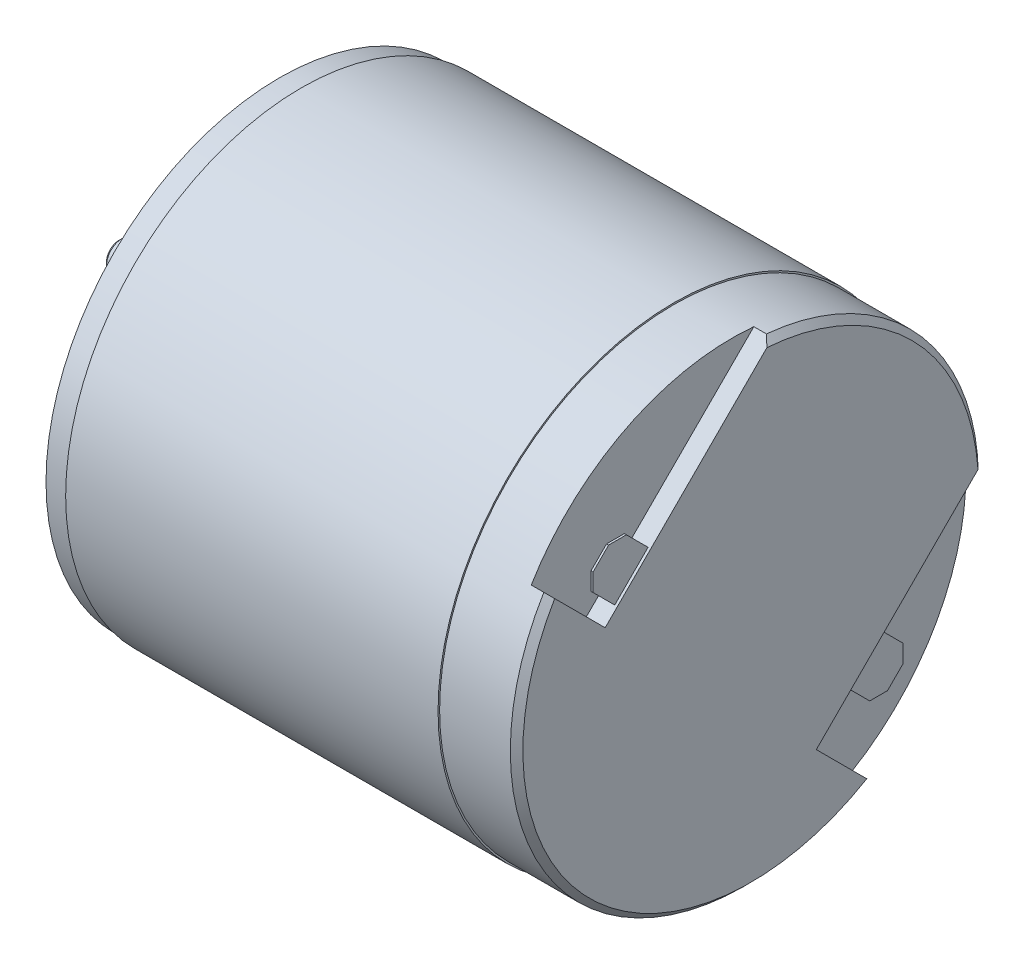
ISO-10303-21;
HEADER;
FILE_DESCRIPTION(('STEP AP214'),'2;1');
FILE_NAME('part.step','',(''),(''),'','','');
FILE_SCHEMA(('AUTOMOTIVE_DESIGN { 1 0 10303 214 1 1 1 1 }'));
ENDSEC;
DATA;
#1=APPLICATION_CONTEXT('core data for automotive mechanical design processes');
#2=APPLICATION_PROTOCOL_DEFINITION('international standard','automotive_design',2000,#1);
#3=PRODUCT_CONTEXT('',#1,'mechanical');
#4=PRODUCT('Part','Part','',(#3));
#5=PRODUCT_RELATED_PRODUCT_CATEGORY('part','',(#4));
#6=PRODUCT_DEFINITION_FORMATION('','',#4);
#7=PRODUCT_DEFINITION_CONTEXT('part definition',#1,'design');
#8=PRODUCT_DEFINITION('design','',#6,#7);
#9=PRODUCT_DEFINITION_SHAPE('','',#8);
#10=(LENGTH_UNIT() NAMED_UNIT(*) SI_UNIT(.MILLI.,.METRE.));
#11=(NAMED_UNIT(*) PLANE_ANGLE_UNIT() SI_UNIT($,.RADIAN.));
#12=(NAMED_UNIT(*) SI_UNIT($,.STERADIAN.) SOLID_ANGLE_UNIT());
#13=UNCERTAINTY_MEASURE_WITH_UNIT(LENGTH_MEASURE(1.E-05),#10,'distance_accuracy_value','');
#14=(GEOMETRIC_REPRESENTATION_CONTEXT(3) GLOBAL_UNCERTAINTY_ASSIGNED_CONTEXT((#13)) GLOBAL_UNIT_ASSIGNED_CONTEXT((#10,
#11,#12)) REPRESENTATION_CONTEXT('',''));
#15=CARTESIAN_POINT('',(0.,0.,0.));
#16=DIRECTION('',(0.,0.,1.));
#17=DIRECTION('',(1.,0.,0.));
#18=AXIS2_PLACEMENT_3D('',#15,#16,#17);
#19=CARTESIAN_POINT('',(0.,0.,0.));
#20=DIRECTION('',(-1.,0.,0.));
#21=DIRECTION('',(0.,0.,1.));
#22=AXIS2_PLACEMENT_3D('',#19,#20,#21);
#23=PLANE('',#22);
#24=DIRECTION('',(0.,0.707106781186548,0.707106781186548));
#25=VECTOR('',#24,1.);
#26=CARTESIAN_POINT('',(0.,-19.0062950903902,-13.9151262658471));
#27=LINE('',#26,#25);
#28=CARTESIAN_POINT('',(0.,4.17193000900063,9.26309883354377));
#29=VERTEX_POINT('',#28);
#30=CARTESIAN_POINT('',(0.,7.38643451642566,12.4776033409688));
#31=VERTEX_POINT('',#30);
#32=EDGE_CURVE('E252',#29,#31,#27,.T.);
#33=ORIENTED_EDGE('',*,*,#32,.T.);
#34=CARTESIAN_POINT('',(0.,0.,0.));
#35=DIRECTION('',(-1.,0.,0.));
#36=DIRECTION('',(0.,0.,1.));
#37=AXIS2_PLACEMENT_3D('',#34,#35,#36);
#38=CIRCLE('',#37,14.5);
#39=CARTESIAN_POINT('',(0.,-12.4776033409688,-7.38643451642566));
#40=VERTEX_POINT('',#39);
#41=EDGE_CURVE('E383',#31,#40,#38,.F.);
#42=ORIENTED_EDGE('',*,*,#41,.T.);
#43=DIRECTION('',(0.,-0.707106781186548,-0.707106781186548));
#44=VECTOR('',#43,1.);
#45=CARTESIAN_POINT('',(0.,-19.0062950903902,-13.9151262658471));
#46=LINE('',#45,#44);
#47=CARTESIAN_POINT('',(0.,-9.26309883354377,-4.17193000900063));
#48=VERTEX_POINT('',#47);
#49=EDGE_CURVE('E238',#48,#40,#46,.T.);
#50=ORIENTED_EDGE('',*,*,#49,.F.);
#51=DIRECTION('',(0.,-0.707106781186547,0.707106781186548));
#52=VECTOR('',#51,1.);
#53=CARTESIAN_POINT('',(0.,9.74319625684644,-23.1782250993909));
#54=LINE('',#53,#52);
#55=CARTESIAN_POINT('',(0.,1.0284522711426,-14.463481113687));
#56=VERTEX_POINT('',#55);
#57=EDGE_CURVE('E236',#56,#48,#54,.T.);
#58=ORIENTED_EDGE('',*,*,#57,.F.);
#59=CARTESIAN_POINT('',(0.,0.,0.));
#60=DIRECTION('',(-1.,0.,0.));
#61=DIRECTION('',(0.,0.,1.));
#62=AXIS2_PLACEMENT_3D('',#59,#60,#61);
#63=CIRCLE('',#62,14.5);
#64=CARTESIAN_POINT('',(0.,14.463481113687,-1.02845227114266));
#65=VERTEX_POINT('',#64);
#66=EDGE_CURVE('E46',#56,#65,#63,.F.);
#67=ORIENTED_EDGE('',*,*,#66,.T.);
#68=DIRECTION('',(0.,-0.707106781186546,0.707106781186549));
#69=VECTOR('',#68,1.);
#70=CARTESIAN_POINT('',(0.,23.1782250993909,-9.74319625684651));
#71=LINE('',#70,#69);
#72=EDGE_CURVE('E260',#65,#29,#71,.T.);
#73=ORIENTED_EDGE('',*,*,#72,.T.);
#74=EDGE_LOOP('',(#33,#42,#50,#58,#67,#73));
#75=FACE_BOUND('',#74,.T.);
#76=ADVANCED_FACE('F32',(#75),#23,.F.);
#77=CARTESIAN_POINT('',(0.,0.,0.));
#78=DIRECTION('',(-1.,0.,0.));
#79=DIRECTION('',(0.,0.,1.));
#80=AXIS2_PLACEMENT_3D('',#77,#78,#79);
#81=CYLINDRICAL_SURFACE('',#80,14.9);
#82=DIRECTION('',(1.,0.,0.));
#83=VECTOR('',#82,1.);
#84=CARTESIAN_POINT('',(-1.2,-12.7693312792475,-7.67816245470436));
#85=LINE('',#84,#83);
#86=CARTESIAN_POINT('',(-1.2,-12.7693312792475,-7.67816245470436));
#87=VERTEX_POINT('',#86);
#88=CARTESIAN_POINT('',(-0.4,-12.7693312792475,-7.67816245470436));
#89=VERTEX_POINT('',#88);
#90=EDGE_CURVE('E253',#87,#89,#85,.T.);
#91=ORIENTED_EDGE('',*,*,#90,.T.);
#92=CARTESIAN_POINT('',(-0.399999999999999,0.,0.));
#93=DIRECTION('',(-1.,0.,0.));
#94=DIRECTION('',(0.,0.,1.));
#95=AXIS2_PLACEMENT_3D('',#92,#93,#94);
#96=CIRCLE('',#95,14.9);
#97=CARTESIAN_POINT('',(-0.4,7.67816245470436,12.7693312792475));
#98=VERTEX_POINT('',#97);
#99=EDGE_CURVE('E349',#89,#98,#96,.T.);
#100=ORIENTED_EDGE('',*,*,#99,.T.);
#101=DIRECTION('',(1.,0.,0.));
#102=VECTOR('',#101,1.);
#103=CARTESIAN_POINT('',(-1.2,7.67816245470436,12.7693312792475));
#104=LINE('',#103,#102);
#105=CARTESIAN_POINT('',(-1.2,7.67816245470436,12.7693312792475));
#106=VERTEX_POINT('',#105);
#107=EDGE_CURVE('E271',#106,#98,#104,.T.);
#108=ORIENTED_EDGE('',*,*,#107,.F.);
#109=CARTESIAN_POINT('',(-1.2,0.,0.));
#110=DIRECTION('',(1.,0.,0.));
#111=DIRECTION('',(0.,0.,-1.));
#112=AXIS2_PLACEMENT_3D('',#109,#110,#111);
#113=CIRCLE('',#112,14.9);
#114=CARTESIAN_POINT('',(-1.2,14.8341639763534,-1.39913513380904));
#115=VERTEX_POINT('',#114);
#116=EDGE_CURVE('E267',#106,#115,#113,.F.);
#117=ORIENTED_EDGE('',*,*,#116,.T.);
#118=DIRECTION('',(1.,0.,0.));
#119=VECTOR('',#118,1.);
#120=CARTESIAN_POINT('',(-1.2,14.8341639763534,-1.39913513380904));
#121=LINE('',#120,#119);
#122=CARTESIAN_POINT('',(-0.399999999999998,14.8341639763534,-1.39913513380904));
#123=VERTEX_POINT('',#122);
#124=EDGE_CURVE('E275',#115,#123,#121,.T.);
#125=ORIENTED_EDGE('',*,*,#124,.T.);
#126=CARTESIAN_POINT('',(-0.399999999999999,0.,0.));
#127=DIRECTION('',(-1.,0.,0.));
#128=DIRECTION('',(0.,0.,1.));
#129=AXIS2_PLACEMENT_3D('',#126,#127,#128);
#130=CIRCLE('',#129,14.9);
#131=CARTESIAN_POINT('',(-0.400000000000001,1.39913513380898,-14.8341639763534));
#132=VERTEX_POINT('',#131);
#133=EDGE_CURVE('E346',#123,#132,#130,.T.);
#134=ORIENTED_EDGE('',*,*,#133,.T.);
#135=DIRECTION('',(1.,0.,0.));
#136=VECTOR('',#135,1.);
#137=CARTESIAN_POINT('',(-1.2,1.39913513380898,-14.8341639763534));
#138=LINE('',#137,#136);
#139=CARTESIAN_POINT('',(-1.2,1.39913513380898,-14.8341639763534));
#140=VERTEX_POINT('',#139);
#141=EDGE_CURVE('E250',#140,#132,#138,.T.);
#142=ORIENTED_EDGE('',*,*,#141,.F.);
#143=CARTESIAN_POINT('',(-1.2,0.,0.));
#144=DIRECTION('',(1.,0.,0.));
#145=DIRECTION('',(0.,0.,-1.));
#146=AXIS2_PLACEMENT_3D('',#143,#144,#145);
#147=CIRCLE('',#146,14.9);
#148=EDGE_CURVE('E246',#140,#87,#147,.F.);
#149=ORIENTED_EDGE('',*,*,#148,.T.);
#150=EDGE_LOOP('',(#91,#100,#108,#117,#125,#134,#142,#149));
#151=FACE_BOUND('',#150,.T.);
#152=CARTESIAN_POINT('',(-4.9,0.,0.));
#153=DIRECTION('',(-1.,0.,0.));
#154=DIRECTION('',(0.,0.,1.));
#155=AXIS2_PLACEMENT_3D('',#152,#153,#154);
#156=CIRCLE('',#155,14.9);
#157=CARTESIAN_POINT('',(-4.9,0.,14.9));
#158=VERTEX_POINT('',#157);
#159=EDGE_CURVE('E303',#158,#158,#156,.T.);
#160=ORIENTED_EDGE('',*,*,#159,.F.);
#161=EDGE_LOOP('',(#160));
#162=FACE_BOUND('',#161,.T.);
#163=ADVANCED_FACE('F425',(#151,#162),#81,.T.);
#164=CARTESIAN_POINT('',(-4.9,14.9,0.));
#165=DIRECTION('',(-1.,0.,0.));
#166=DIRECTION('',(0.,0.,1.));
#167=AXIS2_PLACEMENT_3D('',#164,#165,#166);
#168=PLANE('',#167);
#169=CARTESIAN_POINT('',(-4.9,0.,0.));
#170=DIRECTION('',(-1.,0.,0.));
#171=DIRECTION('',(0.,0.,1.));
#172=AXIS2_PLACEMENT_3D('',#169,#170,#171);
#173=CIRCLE('',#172,15.);
#174=CARTESIAN_POINT('',(-4.9,0.,15.));
#175=VERTEX_POINT('',#174);
#176=EDGE_CURVE('E300',#175,#175,#173,.T.);
#177=ORIENTED_EDGE('',*,*,#176,.F.);
#178=EDGE_LOOP('',(#177));
#179=FACE_BOUND('',#178,.T.);
#180=ORIENTED_EDGE('',*,*,#159,.T.);
#181=EDGE_LOOP('',(#180));
#182=FACE_BOUND('',#181,.T.);
#183=ADVANCED_FACE('F429',(#179,#182),#168,.F.);
#184=CARTESIAN_POINT('',(0.,0.,0.));
#185=DIRECTION('',(-1.,0.,0.));
#186=DIRECTION('',(0.,0.,1.));
#187=AXIS2_PLACEMENT_3D('',#184,#185,#186);
#188=CYLINDRICAL_SURFACE('',#187,15.);
#189=CARTESIAN_POINT('',(-28.6,0.,0.));
#190=DIRECTION('',(-1.,0.,0.));
#191=DIRECTION('',(0.,0.,1.));
#192=AXIS2_PLACEMENT_3D('',#189,#190,#191);
#193=CIRCLE('',#192,15.);
#194=CARTESIAN_POINT('',(-28.6,0.,15.));
#195=VERTEX_POINT('',#194);
#196=EDGE_CURVE('E297',#195,#195,#193,.T.);
#197=ORIENTED_EDGE('',*,*,#196,.F.);
#198=EDGE_LOOP('',(#197));
#199=FACE_BOUND('',#198,.T.);
#200=ORIENTED_EDGE('',*,*,#176,.T.);
#201=EDGE_LOOP('',(#200));
#202=FACE_BOUND('',#201,.T.);
#203=ADVANCED_FACE('F488',(#199,#202),#188,.T.);
#204=CARTESIAN_POINT('',(-28.6,15.,0.));
#205=DIRECTION('',(1.,0.,0.));
#206=DIRECTION('',(0.,0.,-1.));
#207=AXIS2_PLACEMENT_3D('',#204,#205,#206);
#208=PLANE('',#207);
#209=CARTESIAN_POINT('',(-28.6,0.,0.));
#210=DIRECTION('',(-1.,0.,0.));
#211=DIRECTION('',(0.,0.,1.));
#212=AXIS2_PLACEMENT_3D('',#209,#210,#211);
#213=CIRCLE('',#212,14.85);
#214=CARTESIAN_POINT('',(-28.6,0.,14.85));
#215=VERTEX_POINT('',#214);
#216=EDGE_CURVE('E294',#215,#215,#213,.T.);
#217=ORIENTED_EDGE('',*,*,#216,.F.);
#218=EDGE_LOOP('',(#217));
#219=FACE_BOUND('',#218,.T.);
#220=ORIENTED_EDGE('',*,*,#196,.T.);
#221=EDGE_LOOP('',(#220));
#222=FACE_BOUND('',#221,.T.);
#223=ADVANCED_FACE('F484',(#219,#222),#208,.F.);
#224=CARTESIAN_POINT('',(0.,0.,0.));
#225=DIRECTION('',(-1.,0.,0.));
#226=DIRECTION('',(0.,0.,1.));
#227=AXIS2_PLACEMENT_3D('',#224,#225,#226);
#228=CYLINDRICAL_SURFACE('',#227,14.85);
#229=CARTESIAN_POINT('',(-30.,0.,0.));
#230=DIRECTION('',(-1.,0.,0.));
#231=DIRECTION('',(0.,0.,1.));
#232=AXIS2_PLACEMENT_3D('',#229,#230,#231);
#233=CIRCLE('',#232,14.85);
#234=CARTESIAN_POINT('',(-30.,0.,14.85));
#235=VERTEX_POINT('',#234);
#236=EDGE_CURVE('E291',#235,#235,#233,.T.);
#237=ORIENTED_EDGE('',*,*,#236,.F.);
#238=EDGE_LOOP('',(#237));
#239=FACE_BOUND('',#238,.T.);
#240=ORIENTED_EDGE('',*,*,#216,.T.);
#241=EDGE_LOOP('',(#240));
#242=FACE_BOUND('',#241,.T.);
#243=ADVANCED_FACE('F480',(#239,#242),#228,.T.);
#244=CARTESIAN_POINT('',(-30.,14.85,0.));
#245=DIRECTION('',(1.,0.,0.));
#246=DIRECTION('',(0.,0.,-1.));
#247=AXIS2_PLACEMENT_3D('',#244,#245,#246);
#248=PLANE('',#247);
#249=CARTESIAN_POINT('',(-30.,0.,0.));
#250=DIRECTION('',(-1.,0.,0.));
#251=DIRECTION('',(0.,0.,1.));
#252=AXIS2_PLACEMENT_3D('',#249,#250,#251);
#253=CIRCLE('',#252,4.);
#254=CARTESIAN_POINT('',(-30.,0.,4.));
#255=VERTEX_POINT('',#254);
#256=EDGE_CURVE('E288',#255,#255,#253,.T.);
#257=ORIENTED_EDGE('',*,*,#256,.F.);
#258=EDGE_LOOP('',(#257));
#259=FACE_BOUND('',#258,.T.);
#260=ORIENTED_EDGE('',*,*,#236,.T.);
#261=EDGE_LOOP('',(#260));
#262=FACE_BOUND('',#261,.T.);
#263=ADVANCED_FACE('F476',(#259,#262),#248,.F.);
#264=CARTESIAN_POINT('',(0.,0.,0.));
#265=DIRECTION('',(-1.,0.,0.));
#266=DIRECTION('',(0.,0.,1.));
#267=AXIS2_PLACEMENT_3D('',#264,#265,#266);
#268=CYLINDRICAL_SURFACE('',#267,4.);
#269=CARTESIAN_POINT('',(-30.9,0.,0.));
#270=DIRECTION('',(-1.,0.,0.));
#271=DIRECTION('',(0.,0.,1.));
#272=AXIS2_PLACEMENT_3D('',#269,#270,#271);
#273=CIRCLE('',#272,4.);
#274=CARTESIAN_POINT('',(-30.9,0.,4.));
#275=VERTEX_POINT('',#274);
#276=EDGE_CURVE('E285',#275,#275,#273,.T.);
#277=ORIENTED_EDGE('',*,*,#276,.F.);
#278=EDGE_LOOP('',(#277));
#279=FACE_BOUND('',#278,.T.);
#280=ORIENTED_EDGE('',*,*,#256,.T.);
#281=EDGE_LOOP('',(#280));
#282=FACE_BOUND('',#281,.T.);
#283=ADVANCED_FACE('F472',(#279,#282),#268,.T.);
#284=CARTESIAN_POINT('',(-30.9,4.,0.));
#285=DIRECTION('',(1.,0.,0.));
#286=DIRECTION('',(0.,0.,-1.));
#287=AXIS2_PLACEMENT_3D('',#284,#285,#286);
#288=PLANE('',#287);
#289=CARTESIAN_POINT('',(-30.9,0.,0.));
#290=DIRECTION('',(-1.,0.,0.));
#291=DIRECTION('',(0.,0.,1.));
#292=AXIS2_PLACEMENT_3D('',#289,#290,#291);
#293=CIRCLE('',#292,2.1);
#294=CARTESIAN_POINT('',(-30.9,0.,2.1));
#295=VERTEX_POINT('',#294);
#296=EDGE_CURVE('E282',#295,#295,#293,.T.);
#297=ORIENTED_EDGE('',*,*,#296,.F.);
#298=EDGE_LOOP('',(#297));
#299=FACE_BOUND('',#298,.T.);
#300=ORIENTED_EDGE('',*,*,#276,.T.);
#301=EDGE_LOOP('',(#300));
#302=FACE_BOUND('',#301,.T.);
#303=ADVANCED_FACE('F468',(#299,#302),#288,.F.);
#304=CARTESIAN_POINT('',(0.,0.,0.));
#305=DIRECTION('',(-1.,0.,0.));
#306=DIRECTION('',(0.,0.,1.));
#307=AXIS2_PLACEMENT_3D('',#304,#305,#306);
#308=CYLINDRICAL_SURFACE('',#307,2.1);
#309=CARTESIAN_POINT('',(-31.8,0.,0.));
#310=DIRECTION('',(1.,0.,0.));
#311=DIRECTION('',(0.,0.,-1.));
#312=AXIS2_PLACEMENT_3D('',#309,#310,#311);
#313=CIRCLE('',#312,2.1);
#314=CARTESIAN_POINT('',(-31.8,0.,-2.1));
#315=VERTEX_POINT('',#314);
#316=EDGE_CURVE('E11',#315,#315,#313,.T.);
#317=ORIENTED_EDGE('',*,*,#316,.T.);
#318=EDGE_LOOP('',(#317));
#319=FACE_BOUND('',#318,.T.);
#320=ORIENTED_EDGE('',*,*,#296,.T.);
#321=EDGE_LOOP('',(#320));
#322=FACE_BOUND('',#321,.T.);
#323=ADVANCED_FACE('F465',(#319,#322),#308,.T.);
#324=CARTESIAN_POINT('',(-32.,2.1,0.));
#325=DIRECTION('',(1.,0.,0.));
#326=DIRECTION('',(0.,0.,-1.));
#327=AXIS2_PLACEMENT_3D('',#324,#325,#326);
#328=PLANE('',#327);
#329=CARTESIAN_POINT('',(-32.,0.,0.));
#330=DIRECTION('',(1.,0.,0.));
#331=DIRECTION('',(0.,0.,-1.));
#332=AXIS2_PLACEMENT_3D('',#329,#330,#331);
#333=CIRCLE('',#332,1.98452994616208);
#334=CARTESIAN_POINT('',(-32.,0.,-1.98452994616208));
#335=VERTEX_POINT('',#334);
#336=EDGE_CURVE('E39',#335,#335,#333,.F.);
#337=ORIENTED_EDGE('',*,*,#336,.T.);
#338=EDGE_LOOP('',(#337));
#339=FACE_BOUND('',#338,.T.);
#340=CARTESIAN_POINT('',(-32.,0.,0.));
#341=DIRECTION('',(-1.,0.,0.));
#342=DIRECTION('',(0.,0.,1.));
#343=AXIS2_PLACEMENT_3D('',#340,#341,#342);
#344=CIRCLE('',#343,1.);
#345=CARTESIAN_POINT('',(-32.,0.,1.));
#346=VERTEX_POINT('',#345);
#347=EDGE_CURVE('E274',#346,#346,#344,.T.);
#348=ORIENTED_EDGE('',*,*,#347,.F.);
#349=EDGE_LOOP('',(#348));
#350=FACE_BOUND('',#349,.T.);
#351=ADVANCED_FACE('F413',(#339,#350),#328,.F.);
#352=CARTESIAN_POINT('',(0.,0.,0.));
#353=DIRECTION('',(-1.,0.,0.));
#354=DIRECTION('',(0.,0.,1.));
#355=AXIS2_PLACEMENT_3D('',#352,#353,#354);
#356=CYLINDRICAL_SURFACE('',#355,1.);
#357=CARTESIAN_POINT('',(-40.,0.,0.));
#358=DIRECTION('',(1.,0.,0.));
#359=DIRECTION('',(0.,0.,-1.));
#360=AXIS2_PLACEMENT_3D('',#357,#358,#359);
#361=CIRCLE('',#360,1.);
#362=CARTESIAN_POINT('',(-40.,0.,-1.));
#363=VERTEX_POINT('',#362);
#364=EDGE_CURVE('E309',#363,#363,#361,.T.);
#365=ORIENTED_EDGE('',*,*,#364,.T.);
#366=EDGE_LOOP('',(#365));
#367=FACE_BOUND('',#366,.T.);
#368=ORIENTED_EDGE('',*,*,#347,.T.);
#369=EDGE_LOOP('',(#368));
#370=FACE_BOUND('',#369,.T.);
#371=ADVANCED_FACE('F455',(#367,#370),#356,.T.);
#372=CARTESIAN_POINT('',(-40.2,0.999999999999999,0.));
#373=DIRECTION('',(1.,0.,0.));
#374=DIRECTION('',(0.,0.,-1.));
#375=AXIS2_PLACEMENT_3D('',#372,#373,#374);
#376=PLANE('',#375);
#377=CARTESIAN_POINT('',(-40.2,0.,0.));
#378=DIRECTION('',(1.,0.,0.));
#379=DIRECTION('',(0.,0.,-1.));
#380=AXIS2_PLACEMENT_3D('',#377,#378,#379);
#381=CIRCLE('',#380,0.800000000000002);
#382=CARTESIAN_POINT('',(-40.2,0.,-0.800000000000002));
#383=VERTEX_POINT('',#382);
#384=EDGE_CURVE('E306',#383,#383,#381,.F.);
#385=ORIENTED_EDGE('',*,*,#384,.T.);
#386=EDGE_LOOP('',(#385));
#387=FACE_BOUND('',#386,.T.);
#388=ADVANCED_FACE('F451',(#387),#376,.F.);
#389=CARTESIAN_POINT('',(-1.2,-19.0062950903902,-13.9151262658471));
#390=DIRECTION('',(0.,0.707106781186548,-0.707106781186548));
#391=DIRECTION('',(0.,0.707106781186548,0.707106781186548));
#392=AXIS2_PLACEMENT_3D('',#389,#390,#391);
#393=PLANE('',#392);
#394=ORIENTED_EDGE('',*,*,#107,.T.);
#395=CARTESIAN_POINT('',(-0.399999999999999,7.67816245470436,12.7693312792475));
#396=CARTESIAN_POINT('',(-0.333303497507687,7.62956158627321,12.7207304108163));
#397=CARTESIAN_POINT('',(-0.266621912949534,7.58095049054999,12.6721193150931));
#398=CARTESIAN_POINT('',(-0.133288579616163,7.48370784445712,12.5748766690003));
#399=CARTESIAN_POINT('',(-0.0666368308409822,7.43507629408744,12.5262451186306));
#400=CARTESIAN_POINT('',(0.,7.38643451642566,12.4776033409688));
#401=B_SPLINE_CURVE_WITH_KNOTS('',3,(#395,#396,#397,#398,#399,#400),.UNSPECIFIED.,.F.,.F.,(4,2,
4),(0.,0.287319680436435,0.574639361240867),.UNSPECIFIED.);
#402=EDGE_CURVE('E352',#98,#31,#401,.T.);
#403=ORIENTED_EDGE('',*,*,#402,.T.);
#404=ORIENTED_EDGE('',*,*,#32,.F.);
#405=DIRECTION('',(1.,0.,0.));
#406=VECTOR('',#405,1.);
#407=CARTESIAN_POINT('',(-1.2,4.17193000900063,9.26309883354377));
#408=LINE('',#407,#406);
#409=CARTESIAN_POINT('',(-1.2,4.17193000900063,9.26309883354377));
#410=VERTEX_POINT('',#409);
#411=EDGE_CURVE('E270',#410,#29,#408,.T.);
#412=ORIENTED_EDGE('',*,*,#411,.F.);
#413=DIRECTION('',(0.,0.707106781186548,0.707106781186548));
#414=VECTOR('',#413,1.);
#415=CARTESIAN_POINT('',(-1.2,-19.0062950903902,-13.9151262658471));
#416=LINE('',#415,#414);
#417=EDGE_CURVE('E262',#410,#106,#416,.T.);
#418=ORIENTED_EDGE('',*,*,#417,.T.);
#419=EDGE_LOOP('',(#394,#403,#404,#412,#418));
#420=FACE_BOUND('',#419,.T.);
#421=ADVANCED_FACE('F360',(#420),#393,.T.);
#422=CARTESIAN_POINT('',(-1.2,23.1782250993909,-9.74319625684651));
#423=DIRECTION('',(0.,0.707106781186549,0.707106781186546));
#424=DIRECTION('',(0.,-0.707106781186546,0.707106781186549));
#425=AXIS2_PLACEMENT_3D('',#422,#423,#424);
#426=PLANE('',#425);
#427=DIRECTION('',(0.,0.707106781186548,-0.707106781186548));
#428=VECTOR('',#427,1.);
#429=CARTESIAN_POINT('',(-0.17,4.94974746830581,8.48528137423855));
#430=LINE('',#429,#428);
#431=CARTESIAN_POINT('',(-0.17,4.94974746830581,8.48528137423855));
#432=VERTEX_POINT('',#431);
#433=CARTESIAN_POINT('',(-0.17,7.07106781186546,6.36396103067891));
#434=VERTEX_POINT('',#433);
#435=EDGE_CURVE('E220',#432,#434,#430,.T.);
#436=ORIENTED_EDGE('',*,*,#435,.F.);
#437=DIRECTION('',(-1.,0.,0.));
#438=VECTOR('',#437,1.);
#439=CARTESIAN_POINT('',(-0.17,4.94974746830581,8.48528137423855));
#440=LINE('',#439,#438);
#441=CARTESIAN_POINT('',(-0.3,4.94974746830581,8.48528137423855));
#442=VERTEX_POINT('',#441);
#443=EDGE_CURVE('E231',#432,#442,#440,.T.);
#444=ORIENTED_EDGE('',*,*,#443,.T.);
#445=DIRECTION('',(0.,0.707106781186548,-0.707106781186548));
#446=VECTOR('',#445,1.);
#447=CARTESIAN_POINT('',(-0.3,4.94974746830581,8.48528137423855));
#448=LINE('',#447,#446);
#449=CARTESIAN_POINT('',(-0.3,7.07106781186548,6.36396103067892));
#450=VERTEX_POINT('',#449);
#451=EDGE_CURVE('E186',#442,#450,#448,.T.);
#452=ORIENTED_EDGE('',*,*,#451,.T.);
#453=DIRECTION('',(-1.,0.,0.));
#454=VECTOR('',#453,1.);
#455=CARTESIAN_POINT('',(-0.17,7.07106781186546,6.36396103067891));
#456=LINE('',#455,#454);
#457=EDGE_CURVE('E234',#434,#450,#456,.T.);
#458=ORIENTED_EDGE('',*,*,#457,.F.);
#459=EDGE_LOOP('',(#436,#444,#452,#458));
#460=FACE_BOUND('',#459,.T.);
#461=ORIENTED_EDGE('',*,*,#72,.F.);
#462=CARTESIAN_POINT('',(0.,14.463481113687,-1.02845227114266));
#463=CARTESIAN_POINT('',(-0.0662553103929144,14.5254835432952,-1.0904547007508));
#464=CARTESIAN_POINT('',(-0.132716301451681,14.5873749989757,-1.15234615643128));
#465=CARTESIAN_POINT('',(-0.266049634847051,14.7109359531643,-1.27590711061993));
#466=CARTESIAN_POINT('',(-0.332921977121617,14.7726054517059,-1.33757660916158));
#467=CARTESIAN_POINT('',(-0.399999999999999,14.8341639763534,-1.39913513380904));
#468=B_SPLINE_CURVE_WITH_KNOTS('',3,(#462,#463,#464,#465,#466,#467),.UNSPECIFIED.,.F.,.F.,(4,2,
4),(0.,0.32970215520239,0.659404260683057),.UNSPECIFIED.);
#469=EDGE_CURVE('E406',#65,#123,#468,.T.);
#470=ORIENTED_EDGE('',*,*,#469,.T.);
#471=ORIENTED_EDGE('',*,*,#124,.F.);
#472=DIRECTION('',(0.,-0.707106781186546,0.707106781186549));
#473=VECTOR('',#472,1.);
#474=CARTESIAN_POINT('',(-1.2,23.1782250993909,-9.74319625684651));
#475=LINE('',#474,#473);
#476=EDGE_CURVE('E265',#115,#410,#475,.T.);
#477=ORIENTED_EDGE('',*,*,#476,.T.);
#478=ORIENTED_EDGE('',*,*,#411,.T.);
#479=EDGE_LOOP('',(#461,#470,#471,#477,#478));
#480=FACE_BOUND('',#479,.T.);
#481=ADVANCED_FACE('F401',(#460,#480),#426,.T.);
#482=CARTESIAN_POINT('',(-1.2,0.,-32.9214213562373));
#483=DIRECTION('',(1.,0.,0.));
#484=DIRECTION('',(0.,0.,-1.));
#485=AXIS2_PLACEMENT_3D('',#482,#483,#484);
#486=PLANE('',#485);
#487=ORIENTED_EDGE('',*,*,#417,.F.);
#488=ORIENTED_EDGE('',*,*,#476,.F.);
#489=ORIENTED_EDGE('',*,*,#116,.F.);
#490=EDGE_LOOP('',(#487,#488,#489));
#491=FACE_BOUND('',#490,.T.);
#492=ADVANCED_FACE('F399',(#491),#486,.T.);
#493=CARTESIAN_POINT('',(-1.2,9.74319625684644,-23.1782250993909));
#494=DIRECTION('',(0.,0.707106781186548,0.707106781186547));
#495=DIRECTION('',(0.,-0.707106781186547,0.707106781186548));
#496=AXIS2_PLACEMENT_3D('',#493,#494,#495);
#497=PLANE('',#496);
#498=DIRECTION('',(-1.,0.,0.));
#499=VECTOR('',#498,1.);
#500=CARTESIAN_POINT('',(-0.17,-7.07106781186549,-6.36396103067895));
#501=LINE('',#500,#499);
#502=CARTESIAN_POINT('',(-0.17,-7.07106781186548,-6.36396103067893));
#503=VERTEX_POINT('',#502);
#504=CARTESIAN_POINT('',(-0.3,-7.07106781186546,-6.36396103067895));
#505=VERTEX_POINT('',#504);
#506=EDGE_CURVE('E187',#503,#505,#501,.T.);
#507=ORIENTED_EDGE('',*,*,#506,.F.);
#508=DIRECTION('',(0.,-0.707106781186548,0.707106781186547));
#509=VECTOR('',#508,1.);
#510=CARTESIAN_POINT('',(-0.17,-4.94974746830585,-8.48528137423859));
#511=LINE('',#510,#509);
#512=CARTESIAN_POINT('',(-0.17,-4.94974746830583,-8.48528137423858));
#513=VERTEX_POINT('',#512);
#514=EDGE_CURVE('E185',#513,#503,#511,.T.);
#515=ORIENTED_EDGE('',*,*,#514,.F.);
#516=DIRECTION('',(-1.,0.,0.));
#517=VECTOR('',#516,1.);
#518=CARTESIAN_POINT('',(-0.17,-4.94974746830585,-8.48528137423859));
#519=LINE('',#518,#517);
#520=CARTESIAN_POINT('',(-0.3,-4.94974746830585,-8.48528137423859));
#521=VERTEX_POINT('',#520);
#522=EDGE_CURVE('E173',#513,#521,#519,.T.);
#523=ORIENTED_EDGE('',*,*,#522,.T.);
#524=DIRECTION('',(0.,-0.707106781186548,0.707106781186547));
#525=VECTOR('',#524,1.);
#526=CARTESIAN_POINT('',(-0.3,-4.94974746830585,-8.48528137423859));
#527=LINE('',#526,#525);
#528=EDGE_CURVE('E178',#521,#505,#527,.T.);
#529=ORIENTED_EDGE('',*,*,#528,.T.);
#530=EDGE_LOOP('',(#507,#515,#523,#529));
#531=FACE_BOUND('',#530,.T.);
#532=ORIENTED_EDGE('',*,*,#141,.T.);
#533=CARTESIAN_POINT('',(-0.399999999999999,1.39913513380898,-14.8341639763534));
#534=CARTESIAN_POINT('',(-0.332921977121616,1.33757660916152,-14.772605451706));
#535=CARTESIAN_POINT('',(-0.266049634847049,1.27590711061988,-14.7109359531643));
#536=CARTESIAN_POINT('',(-0.132716301451679,1.15234615643123,-14.5873749989757));
#537=CARTESIAN_POINT('',(-0.0662553103929133,1.09045470075074,-14.5254835432952));
#538=CARTESIAN_POINT('',(0.,1.02845227114261,-14.463481113687));
#539=B_SPLINE_CURVE_WITH_KNOTS('',3,(#533,#534,#535,#536,#537,#538),.UNSPECIFIED.,.F.,.F.,(4,2,
4),(0.,0.329702105480666,0.659404260683055),.UNSPECIFIED.);
#540=EDGE_CURVE('E54',#132,#56,#539,.T.);
#541=ORIENTED_EDGE('',*,*,#540,.T.);
#542=ORIENTED_EDGE('',*,*,#57,.T.);
#543=DIRECTION('',(1.,0.,0.));
#544=VECTOR('',#543,1.);
#545=CARTESIAN_POINT('',(-1.2,-9.26309883354377,-4.17193000900063));
#546=LINE('',#545,#544);
#547=CARTESIAN_POINT('',(-1.2,-9.26309883354377,-4.17193000900063));
#548=VERTEX_POINT('',#547);
#549=EDGE_CURVE('E249',#548,#48,#546,.T.);
#550=ORIENTED_EDGE('',*,*,#549,.F.);
#551=DIRECTION('',(0.,-0.707106781186547,0.707106781186548));
#552=VECTOR('',#551,1.);
#553=CARTESIAN_POINT('',(-1.2,9.74319625684644,-23.1782250993909));
#554=LINE('',#553,#552);
#555=EDGE_CURVE('E241',#140,#548,#554,.T.);
#556=ORIENTED_EDGE('',*,*,#555,.F.);
#557=EDGE_LOOP('',(#532,#541,#542,#550,#556));
#558=FACE_BOUND('',#557,.T.);
#559=ADVANCED_FACE('F182',(#531,#558),#497,.F.);
#560=CARTESIAN_POINT('',(-1.2,-19.0062950903902,-13.9151262658471));
#561=DIRECTION('',(0.,-0.707106781186548,0.707106781186548));
#562=DIRECTION('',(0.,-0.707106781186548,-0.707106781186548));
#563=AXIS2_PLACEMENT_3D('',#560,#561,#562);
#564=PLANE('',#563);
#565=ORIENTED_EDGE('',*,*,#49,.T.);
#566=CARTESIAN_POINT('',(0.,-12.4776033409688,-7.38643451642566));
#567=CARTESIAN_POINT('',(-0.0666368308409826,-12.5262451186306,-7.43507629408744));
#568=CARTESIAN_POINT('',(-0.133288579616163,-12.5748766690003,-7.48370784445712));
#569=CARTESIAN_POINT('',(-0.266621912949535,-12.6721193150931,-7.58095049054999));
#570=CARTESIAN_POINT('',(-0.333303497507687,-12.7207304108163,-7.62956158627321));
#571=CARTESIAN_POINT('',(-0.399999999999999,-12.7693312792475,-7.67816245470436));
#572=B_SPLINE_CURVE_WITH_KNOTS('',3,(#566,#567,#568,#569,#570,#571),.UNSPECIFIED.,.F.,.F.,(4,2,
4),(0.,0.287319680804432,0.574639361240866),.UNSPECIFIED.);
#573=EDGE_CURVE('E377',#40,#89,#572,.T.);
#574=ORIENTED_EDGE('',*,*,#573,.T.);
#575=ORIENTED_EDGE('',*,*,#90,.F.);
#576=DIRECTION('',(0.,-0.707106781186548,-0.707106781186548));
#577=VECTOR('',#576,1.);
#578=CARTESIAN_POINT('',(-1.2,-19.0062950903902,-13.9151262658471));
#579=LINE('',#578,#577);
#580=EDGE_CURVE('E244',#548,#87,#579,.T.);
#581=ORIENTED_EDGE('',*,*,#580,.F.);
#582=ORIENTED_EDGE('',*,*,#549,.T.);
#583=EDGE_LOOP('',(#565,#574,#575,#581,#582));
#584=FACE_BOUND('',#583,.T.);
#585=ADVANCED_FACE('F389',(#584),#564,.F.);
#586=CARTESIAN_POINT('',(-1.2,0.,-32.9214213562373));
#587=DIRECTION('',(1.,0.,0.));
#588=DIRECTION('',(0.,0.,-1.));
#589=AXIS2_PLACEMENT_3D('',#586,#587,#588);
#590=PLANE('',#589);
#591=ORIENTED_EDGE('',*,*,#555,.T.);
#592=ORIENTED_EDGE('',*,*,#580,.T.);
#593=ORIENTED_EDGE('',*,*,#148,.F.);
#594=EDGE_LOOP('',(#591,#592,#593));
#595=FACE_BOUND('',#594,.T.);
#596=ADVANCED_FACE('F393',(#595),#590,.T.);
#597=CARTESIAN_POINT('',(-40.2,0.,0.));
#598=DIRECTION('',(1.,0.,0.));
#599=DIRECTION('',(0.,0.,-1.));
#600=AXIS2_PLACEMENT_3D('',#597,#598,#599);
#601=CONICAL_SURFACE('',#600,0.800000000000002,0.785398163397462);
#602=ORIENTED_EDGE('',*,*,#364,.F.);
#603=EDGE_LOOP('',(#602));
#604=FACE_BOUND('',#603,.T.);
#605=ORIENTED_EDGE('',*,*,#384,.F.);
#606=EDGE_LOOP('',(#605));
#607=FACE_BOUND('',#606,.T.);
#608=ADVANCED_FACE('F555',(#604,#607),#601,.T.);
#609=CARTESIAN_POINT('',(-0.17,7.07106781186546,6.36396103067891));
#610=DIRECTION('',(0.,-0.707106781186547,0.707106781186547));
#611=DIRECTION('',(0.,-0.707106781186548,-0.707106781186548));
#612=AXIS2_PLACEMENT_3D('',#609,#610,#611);
#613=PLANE('',#612);
#614=DIRECTION('',(0.,0.707106781186548,0.707106781186548));
#615=VECTOR('',#614,1.);
#616=CARTESIAN_POINT('',(-0.3,7.07106781186546,6.36396103067891));
#617=LINE('',#616,#615);
#618=CARTESIAN_POINT('',(-0.3,8.44992603517922,7.74281925399267));
#619=VERTEX_POINT('',#618);
#620=EDGE_CURVE('E212',#450,#619,#617,.T.);
#621=ORIENTED_EDGE('',*,*,#620,.T.);
#622=DIRECTION('',(1.,0.,0.));
#623=VECTOR('',#622,1.);
#624=CARTESIAN_POINT('',(-0.17,8.44992603517922,7.74281925399267));
#625=LINE('',#624,#623);
#626=CARTESIAN_POINT('',(-0.17,8.44992603517922,7.74281925399267));
#627=VERTEX_POINT('',#626);
#628=EDGE_CURVE('E344',#619,#627,#625,.T.);
#629=ORIENTED_EDGE('',*,*,#628,.T.);
#630=DIRECTION('',(0.,0.707106781186548,0.707106781186548));
#631=VECTOR('',#630,1.);
#632=CARTESIAN_POINT('',(-0.17,7.07106781186546,6.36396103067891));
#633=LINE('',#632,#631);
#634=EDGE_CURVE('E223',#434,#627,#633,.T.);
#635=ORIENTED_EDGE('',*,*,#634,.F.);
#636=ORIENTED_EDGE('',*,*,#457,.T.);
#637=EDGE_LOOP('',(#621,#629,#635,#636));
#638=FACE_BOUND('',#637,.T.);
#639=ADVANCED_FACE('F560',(#638),#613,.F.);
#640=CARTESIAN_POINT('',(-0.17,9.01561146012846,8.30850467894192));
#641=DIRECTION('',(0.,-0.707106781186547,-0.707106781186548));
#642=DIRECTION('',(0.,0.707106781186548,-0.707106781186547));
#643=AXIS2_PLACEMENT_3D('',#640,#641,#642);
#644=PLANE('',#643);
#645=DIRECTION('',(0.,-0.707106781186548,0.707106781186547));
#646=VECTOR('',#645,1.);
#647=CARTESIAN_POINT('',(-0.3,9.01561146012846,8.30850467894192));
#648=LINE('',#647,#646);
#649=CARTESIAN_POINT('',(-0.3,8.44992603517922,8.87419010389116));
#650=VERTEX_POINT('',#649);
#651=CARTESIAN_POINT('',(-0.3,7.45997654151806,9.86413959755232));
#652=VERTEX_POINT('',#651);
#653=EDGE_CURVE('E215',#650,#652,#648,.T.);
#654=ORIENTED_EDGE('',*,*,#653,.T.);
#655=DIRECTION('',(1.,0.,0.));
#656=VECTOR('',#655,1.);
#657=CARTESIAN_POINT('',(-0.17,7.45997654151806,9.86413959755232));
#658=LINE('',#657,#656);
#659=CARTESIAN_POINT('',(-0.17,7.45997654151806,9.86413959755232));
#660=VERTEX_POINT('',#659);
#661=EDGE_CURVE('E338',#652,#660,#658,.T.);
#662=ORIENTED_EDGE('',*,*,#661,.T.);
#663=DIRECTION('',(0.,-0.707106781186548,0.707106781186547));
#664=VECTOR('',#663,1.);
#665=CARTESIAN_POINT('',(-0.17,9.01561146012846,8.30850467894192));
#666=LINE('',#665,#664);
#667=CARTESIAN_POINT('',(-0.17,8.44992603517922,8.87419010389116));
#668=VERTEX_POINT('',#667);
#669=EDGE_CURVE('E226',#668,#660,#666,.T.);
#670=ORIENTED_EDGE('',*,*,#669,.F.);
#671=DIRECTION('',(-1.,0.,0.));
#672=VECTOR('',#671,1.);
#673=CARTESIAN_POINT('',(-0.17,8.44992603517922,8.87419010389116));
#674=LINE('',#673,#672);
#675=EDGE_CURVE('E335',#668,#650,#674,.T.);
#676=ORIENTED_EDGE('',*,*,#675,.T.);
#677=EDGE_LOOP('',(#654,#662,#670,#676));
#678=FACE_BOUND('',#677,.T.);
#679=ADVANCED_FACE('F569',(#678),#644,.F.);
#680=CARTESIAN_POINT('',(-0.17,6.89429111656882,10.4298250225016));
#681=DIRECTION('',(0.,0.707106781186548,-0.707106781186547));
#682=DIRECTION('',(0.,0.707106781186547,0.707106781186548));
#683=AXIS2_PLACEMENT_3D('',#680,#681,#682);
#684=PLANE('',#683);
#685=DIRECTION('',(0.,-0.707106781186547,-0.707106781186548));
#686=VECTOR('',#685,1.);
#687=CARTESIAN_POINT('',(-0.17,6.89429111656882,10.4298250225016));
#688=LINE('',#687,#686);
#689=CARTESIAN_POINT('',(-0.17,6.32860569161958,9.86413959755232));
#690=VERTEX_POINT('',#689);
#691=EDGE_CURVE('E229',#690,#432,#688,.T.);
#692=ORIENTED_EDGE('',*,*,#691,.F.);
#693=DIRECTION('',(-1.,0.,0.));
#694=VECTOR('',#693,1.);
#695=CARTESIAN_POINT('',(-0.17,6.32860569161958,9.86413959755232));
#696=LINE('',#695,#694);
#697=CARTESIAN_POINT('',(-0.3,6.32860569161958,9.86413959755232));
#698=VERTEX_POINT('',#697);
#699=EDGE_CURVE('E328',#690,#698,#696,.T.);
#700=ORIENTED_EDGE('',*,*,#699,.T.);
#701=DIRECTION('',(0.,-0.707106781186547,-0.707106781186548));
#702=VECTOR('',#701,1.);
#703=CARTESIAN_POINT('',(-0.3,6.89429111656882,10.4298250225016));
#704=LINE('',#703,#702);
#705=EDGE_CURVE('E218',#698,#442,#704,.T.);
#706=ORIENTED_EDGE('',*,*,#705,.T.);
#707=ORIENTED_EDGE('',*,*,#443,.F.);
#708=EDGE_LOOP('',(#692,#700,#706,#707));
#709=FACE_BOUND('',#708,.T.);
#710=ADVANCED_FACE('F579',(#709),#684,.F.);
#711=CARTESIAN_POINT('',(-0.17,7.07106781186546,6.36396103067891));
#712=DIRECTION('',(1.,0.,0.));
#713=DIRECTION('',(0.,0.,-1.));
#714=AXIS2_PLACEMENT_3D('',#711,#712,#713);
#715=PLANE('',#714);
#716=ORIENTED_EDGE('',*,*,#669,.T.);
#717=DIRECTION('',(0.,1.,0.));
#718=VECTOR('',#717,1.);
#719=CARTESIAN_POINT('',(-0.17,7.07106781186547,9.86413959755232));
#720=LINE('',#719,#718);
#721=EDGE_CURVE('E342',#660,#690,#720,.F.);
#722=ORIENTED_EDGE('',*,*,#721,.T.);
#723=ORIENTED_EDGE('',*,*,#691,.T.);
#724=ORIENTED_EDGE('',*,*,#435,.T.);
#725=ORIENTED_EDGE('',*,*,#634,.T.);
#726=DIRECTION('',(0.,0.,-1.));
#727=VECTOR('',#726,1.);
#728=CARTESIAN_POINT('',(-0.17,8.44992603517922,6.36396103067891));
#729=LINE('',#728,#727);
#730=EDGE_CURVE('E340',#627,#668,#729,.F.);
#731=ORIENTED_EDGE('',*,*,#730,.T.);
#732=EDGE_LOOP('',(#716,#722,#723,#724,#725,#731));
#733=FACE_BOUND('',#732,.T.);
#734=ADVANCED_FACE('F589',(#733),#715,.T.);
#735=CARTESIAN_POINT('',(-0.3,7.07106781186546,6.36396103067891));
#736=DIRECTION('',(1.,0.,0.));
#737=DIRECTION('',(0.,0.,-1.));
#738=AXIS2_PLACEMENT_3D('',#735,#736,#737);
#739=PLANE('',#738);
#740=ORIENTED_EDGE('',*,*,#705,.F.);
#741=DIRECTION('',(0.,-1.,0.));
#742=VECTOR('',#741,1.);
#743=CARTESIAN_POINT('',(-0.3,6.32860569161958,9.86413959755232));
#744=LINE('',#743,#742);
#745=EDGE_CURVE('E333',#698,#652,#744,.F.);
#746=ORIENTED_EDGE('',*,*,#745,.T.);
#747=ORIENTED_EDGE('',*,*,#653,.F.);
#748=DIRECTION('',(0.,0.,1.));
#749=VECTOR('',#748,1.);
#750=CARTESIAN_POINT('',(-0.3,8.44992603517922,8.87419010389116));
#751=LINE('',#750,#749);
#752=EDGE_CURVE('E331',#650,#619,#751,.F.);
#753=ORIENTED_EDGE('',*,*,#752,.T.);
#754=ORIENTED_EDGE('',*,*,#620,.F.);
#755=ORIENTED_EDGE('',*,*,#451,.F.);
#756=EDGE_LOOP('',(#740,#746,#747,#753,#754,#755));
#757=FACE_BOUND('',#756,.T.);
#758=ADVANCED_FACE('F599',(#757),#739,.F.);
#759=CARTESIAN_POINT('',(-0.17,-6.89429111656885,-10.4298250225016));
#760=DIRECTION('',(0.,-0.707106781186548,0.707106781186547));
#761=DIRECTION('',(0.,-0.707106781186547,-0.707106781186548));
#762=AXIS2_PLACEMENT_3D('',#759,#760,#761);
#763=PLANE('',#762);
#764=DIRECTION('',(0.,0.707106781186547,0.707106781186548));
#765=VECTOR('',#764,1.);
#766=CARTESIAN_POINT('',(-0.17,-6.89429111656885,-10.4298250225016));
#767=LINE('',#766,#765);
#768=CARTESIAN_POINT('',(-0.17,-6.3286056916196,-9.86413959755235));
#769=VERTEX_POINT('',#768);
#770=EDGE_CURVE('E200',#769,#513,#767,.T.);
#771=ORIENTED_EDGE('',*,*,#770,.F.);
#772=DIRECTION('',(-1.,0.,0.));
#773=VECTOR('',#772,1.);
#774=CARTESIAN_POINT('',(-0.17,-6.3286056916196,-9.86413959755235));
#775=LINE('',#774,#773);
#776=CARTESIAN_POINT('',(-0.3,-6.3286056916196,-9.86413959755235));
#777=VERTEX_POINT('',#776);
#778=EDGE_CURVE('E175',#769,#777,#775,.T.);
#779=ORIENTED_EDGE('',*,*,#778,.T.);
#780=DIRECTION('',(0.,0.707106781186547,0.707106781186548));
#781=VECTOR('',#780,1.);
#782=CARTESIAN_POINT('',(-0.3,-6.89429111656885,-10.4298250225016));
#783=LINE('',#782,#781);
#784=EDGE_CURVE('E169',#777,#521,#783,.T.);
#785=ORIENTED_EDGE('',*,*,#784,.T.);
#786=ORIENTED_EDGE('',*,*,#522,.F.);
#787=EDGE_LOOP('',(#771,#779,#785,#786));
#788=FACE_BOUND('',#787,.T.);
#789=ADVANCED_FACE('F172',(#788),#763,.F.);
#790=CARTESIAN_POINT('',(-0.17,-7.07106781186549,-6.36396103067895));
#791=DIRECTION('',(0.,0.707106781186548,-0.707106781186547));
#792=DIRECTION('',(0.,0.707106781186547,0.707106781186548));
#793=AXIS2_PLACEMENT_3D('',#790,#791,#792);
#794=PLANE('',#793);
#795=DIRECTION('',(0.,-0.707106781186547,-0.707106781186548));
#796=VECTOR('',#795,1.);
#797=CARTESIAN_POINT('',(-0.3,-7.07106781186549,-6.36396103067895));
#798=LINE('',#797,#796);
#799=CARTESIAN_POINT('',(-0.3,-8.44992603517925,-7.74281925399271));
#800=VERTEX_POINT('',#799);
#801=EDGE_CURVE('E193',#505,#800,#798,.T.);
#802=ORIENTED_EDGE('',*,*,#801,.T.);
#803=DIRECTION('',(1.,0.,0.));
#804=VECTOR('',#803,1.);
#805=CARTESIAN_POINT('',(-0.17,-8.44992603517925,-7.74281925399271));
#806=LINE('',#805,#804);
#807=CARTESIAN_POINT('',(-0.17,-8.44992603517925,-7.74281925399271));
#808=VERTEX_POINT('',#807);
#809=EDGE_CURVE('E321',#800,#808,#806,.T.);
#810=ORIENTED_EDGE('',*,*,#809,.T.);
#811=DIRECTION('',(0.,-0.707106781186547,-0.707106781186548));
#812=VECTOR('',#811,1.);
#813=CARTESIAN_POINT('',(-0.17,-7.07106781186549,-6.36396103067895));
#814=LINE('',#813,#812);
#815=EDGE_CURVE('E203',#503,#808,#814,.T.);
#816=ORIENTED_EDGE('',*,*,#815,.F.);
#817=ORIENTED_EDGE('',*,*,#506,.T.);
#818=EDGE_LOOP('',(#802,#810,#816,#817));
#819=FACE_BOUND('',#818,.T.);
#820=ADVANCED_FACE('F618',(#819),#794,.F.);
#821=CARTESIAN_POINT('',(-0.17,-9.01561146012849,-8.30850467894195));
#822=DIRECTION('',(0.,0.707106781186547,0.707106781186547));
#823=DIRECTION('',(0.,-0.707106781186548,0.707106781186548));
#824=AXIS2_PLACEMENT_3D('',#821,#822,#823);
#825=PLANE('',#824);
#826=DIRECTION('',(0.,0.707106781186547,-0.707106781186547));
#827=VECTOR('',#826,1.);
#828=CARTESIAN_POINT('',(-0.17,-9.01561146012849,-8.30850467894195));
#829=LINE('',#828,#827);
#830=CARTESIAN_POINT('',(-0.17,-8.44992603517925,-8.87419010389119));
#831=VERTEX_POINT('',#830);
#832=CARTESIAN_POINT('',(-0.17,-7.4599765415181,-9.86413959755235));
#833=VERTEX_POINT('',#832);
#834=EDGE_CURVE('E206',#831,#833,#829,.T.);
#835=ORIENTED_EDGE('',*,*,#834,.F.);
#836=DIRECTION('',(-1.,0.,0.));
#837=VECTOR('',#836,1.);
#838=CARTESIAN_POINT('',(-0.17,-8.44992603517925,-8.87419010389119));
#839=LINE('',#838,#837);
#840=CARTESIAN_POINT('',(-0.3,-8.44992603517925,-8.87419010389119));
#841=VERTEX_POINT('',#840);
#842=EDGE_CURVE('E314',#831,#841,#839,.T.);
#843=ORIENTED_EDGE('',*,*,#842,.T.);
#844=DIRECTION('',(0.,0.707106781186547,-0.707106781186547));
#845=VECTOR('',#844,1.);
#846=CARTESIAN_POINT('',(-0.3,-9.01561146012849,-8.30850467894195));
#847=LINE('',#846,#845);
#848=CARTESIAN_POINT('',(-0.3,-7.4599765415181,-9.86413959755235));
#849=VERTEX_POINT('',#848);
#850=EDGE_CURVE('E195',#841,#849,#847,.T.);
#851=ORIENTED_EDGE('',*,*,#850,.T.);
#852=DIRECTION('',(1.,0.,0.));
#853=VECTOR('',#852,1.);
#854=CARTESIAN_POINT('',(-0.17,-7.4599765415181,-9.86413959755235));
#855=LINE('',#854,#853);
#856=EDGE_CURVE('E312',#849,#833,#855,.T.);
#857=ORIENTED_EDGE('',*,*,#856,.T.);
#858=EDGE_LOOP('',(#835,#843,#851,#857));
#859=FACE_BOUND('',#858,.T.);
#860=ADVANCED_FACE('F627',(#859),#825,.F.);
#861=CARTESIAN_POINT('',(-0.17,-4.94974746830585,-8.48528137423859));
#862=DIRECTION('',(1.,0.,0.));
#863=DIRECTION('',(0.,0.,-1.));
#864=AXIS2_PLACEMENT_3D('',#861,#862,#863);
#865=PLANE('',#864);
#866=ORIENTED_EDGE('',*,*,#815,.T.);
#867=DIRECTION('',(0.,0.,1.));
#868=VECTOR('',#867,1.);
#869=CARTESIAN_POINT('',(-0.17,-8.44992603517925,-8.48528137423858));
#870=LINE('',#869,#868);
#871=EDGE_CURVE('E325',#808,#831,#870,.F.);
#872=ORIENTED_EDGE('',*,*,#871,.T.);
#873=ORIENTED_EDGE('',*,*,#834,.T.);
#874=DIRECTION('',(0.,-1.,0.));
#875=VECTOR('',#874,1.);
#876=CARTESIAN_POINT('',(-0.17,-4.94974746830585,-9.86413959755235));
#877=LINE('',#876,#875);
#878=EDGE_CURVE('E323',#833,#769,#877,.F.);
#879=ORIENTED_EDGE('',*,*,#878,.T.);
#880=ORIENTED_EDGE('',*,*,#770,.T.);
#881=ORIENTED_EDGE('',*,*,#514,.T.);
#882=EDGE_LOOP('',(#866,#872,#873,#879,#880,#881));
#883=FACE_BOUND('',#882,.T.);
#884=ADVANCED_FACE('F637',(#883),#865,.T.);
#885=CARTESIAN_POINT('',(-0.3,-4.94974746830585,-8.48528137423859));
#886=DIRECTION('',(1.,0.,0.));
#887=DIRECTION('',(0.,0.,-1.));
#888=AXIS2_PLACEMENT_3D('',#885,#886,#887);
#889=PLANE('',#888);
#890=ORIENTED_EDGE('',*,*,#850,.F.);
#891=DIRECTION('',(0.,0.,-1.));
#892=VECTOR('',#891,1.);
#893=CARTESIAN_POINT('',(-0.3,-8.44992603517925,-8.87419010389119));
#894=LINE('',#893,#892);
#895=EDGE_CURVE('E319',#841,#800,#894,.F.);
#896=ORIENTED_EDGE('',*,*,#895,.T.);
#897=ORIENTED_EDGE('',*,*,#801,.F.);
#898=ORIENTED_EDGE('',*,*,#528,.F.);
#899=ORIENTED_EDGE('',*,*,#784,.F.);
#900=DIRECTION('',(0.,1.,0.));
#901=VECTOR('',#900,1.);
#902=CARTESIAN_POINT('',(-0.3,-6.3286056916196,-9.86413959755235));
#903=LINE('',#902,#901);
#904=EDGE_CURVE('E317',#777,#849,#903,.F.);
#905=ORIENTED_EDGE('',*,*,#904,.T.);
#906=EDGE_LOOP('',(#890,#896,#897,#898,#899,#905));
#907=FACE_BOUND('',#906,.T.);
#908=ADVANCED_FACE('F191',(#907),#889,.F.);
#909=CARTESIAN_POINT('',(-0.17,-8.44992603517925,-8.87419010389119));
#910=DIRECTION('',(0.,1.,0.));
#911=DIRECTION('',(0.,0.,1.));
#912=AXIS2_PLACEMENT_3D('',#909,#910,#911);
#913=PLANE('',#912);
#914=ORIENTED_EDGE('',*,*,#871,.F.);
#915=ORIENTED_EDGE('',*,*,#809,.F.);
#916=ORIENTED_EDGE('',*,*,#895,.F.);
#917=ORIENTED_EDGE('',*,*,#842,.F.);
#918=EDGE_LOOP('',(#914,#915,#916,#917));
#919=FACE_BOUND('',#918,.T.);
#920=ADVANCED_FACE('F656',(#919),#913,.F.);
#921=CARTESIAN_POINT('',(-0.17,-6.3286056916196,-9.86413959755235));
#922=DIRECTION('',(0.,0.,1.));
#923=DIRECTION('',(0.,-1.,0.));
#924=AXIS2_PLACEMENT_3D('',#921,#922,#923);
#925=PLANE('',#924);
#926=ORIENTED_EDGE('',*,*,#878,.F.);
#927=ORIENTED_EDGE('',*,*,#856,.F.);
#928=ORIENTED_EDGE('',*,*,#904,.F.);
#929=ORIENTED_EDGE('',*,*,#778,.F.);
#930=EDGE_LOOP('',(#926,#927,#928,#929));
#931=FACE_BOUND('',#930,.T.);
#932=ADVANCED_FACE('F665',(#931),#925,.F.);
#933=CARTESIAN_POINT('',(-0.17,6.32860569161958,9.86413959755232));
#934=DIRECTION('',(0.,0.,-1.));
#935=DIRECTION('',(0.,1.,0.));
#936=AXIS2_PLACEMENT_3D('',#933,#934,#935);
#937=PLANE('',#936);
#938=ORIENTED_EDGE('',*,*,#721,.F.);
#939=ORIENTED_EDGE('',*,*,#661,.F.);
#940=ORIENTED_EDGE('',*,*,#745,.F.);
#941=ORIENTED_EDGE('',*,*,#699,.F.);
#942=EDGE_LOOP('',(#938,#939,#940,#941));
#943=FACE_BOUND('',#942,.T.);
#944=ADVANCED_FACE('F675',(#943),#937,.F.);
#945=CARTESIAN_POINT('',(-0.17,8.44992603517922,8.87419010389116));
#946=DIRECTION('',(0.,-1.,0.));
#947=DIRECTION('',(0.,0.,-1.));
#948=AXIS2_PLACEMENT_3D('',#945,#946,#947);
#949=PLANE('',#948);
#950=ORIENTED_EDGE('',*,*,#730,.F.);
#951=ORIENTED_EDGE('',*,*,#628,.F.);
#952=ORIENTED_EDGE('',*,*,#752,.F.);
#953=ORIENTED_EDGE('',*,*,#675,.F.);
#954=EDGE_LOOP('',(#950,#951,#952,#953));
#955=FACE_BOUND('',#954,.T.);
#956=ADVANCED_FACE('F370',(#955),#949,.F.);
#957=CARTESIAN_POINT('',(-0.399999999999999,0.,0.));
#958=DIRECTION('',(-1.,0.,0.));
#959=DIRECTION('',(0.,0.,1.));
#960=AXIS2_PLACEMENT_3D('',#957,#958,#959);
#961=CONICAL_SURFACE('',#960,14.9,0.785398163397453);
#962=ORIENTED_EDGE('',*,*,#573,.F.);
#963=ORIENTED_EDGE('',*,*,#41,.F.);
#964=ORIENTED_EDGE('',*,*,#402,.F.);
#965=ORIENTED_EDGE('',*,*,#99,.F.);
#966=EDGE_LOOP('',(#962,#963,#964,#965));
#967=FACE_BOUND('',#966,.T.);
#968=ADVANCED_FACE('F364',(#967),#961,.T.);
#969=CARTESIAN_POINT('',(-0.399999999999999,0.,0.));
#970=DIRECTION('',(-1.,0.,0.));
#971=DIRECTION('',(0.,0.,1.));
#972=AXIS2_PLACEMENT_3D('',#969,#970,#971);
#973=CONICAL_SURFACE('',#972,14.9,0.785398163397451);
#974=ORIENTED_EDGE('',*,*,#469,.F.);
#975=ORIENTED_EDGE('',*,*,#66,.F.);
#976=ORIENTED_EDGE('',*,*,#540,.F.);
#977=ORIENTED_EDGE('',*,*,#133,.F.);
#978=EDGE_LOOP('',(#974,#975,#976,#977));
#979=FACE_BOUND('',#978,.T.);
#980=ADVANCED_FACE('F369',(#979),#973,.T.);
#981=CARTESIAN_POINT('',(-32.,0.,0.));
#982=DIRECTION('',(1.,0.,0.));
#983=DIRECTION('',(0.,0.,-1.));
#984=AXIS2_PLACEMENT_3D('',#981,#982,#983);
#985=CONICAL_SURFACE('',#984,1.98452994616208,0.523598775598306);
#986=ORIENTED_EDGE('',*,*,#316,.F.);
#987=EDGE_LOOP('',(#986));
#988=FACE_BOUND('',#987,.T.);
#989=ORIENTED_EDGE('',*,*,#336,.F.);
#990=EDGE_LOOP('',(#989));
#991=FACE_BOUND('',#990,.T.);
#992=ADVANCED_FACE('F416',(#988,#991),#985,.T.);
#993=CLOSED_SHELL('',(#76,#163,#183,#203,#223,#243,#263,#283,#303,#323,#351,#371,#388,#421,#481,
#492,#559,#585,#596,#608,#639,#679,#710,#734,#758,#789,#820,#860,#884,#908,#920,#932,#944,#956,
#968,#980,#992));
#994=MANIFOLD_SOLID_BREP('B2',#993);
#995=ADVANCED_BREP_SHAPE_REPRESENTATION('',(#18,#994),#14);
#996=SHAPE_DEFINITION_REPRESENTATION(#9,#995);
ENDSEC;
END-ISO-10303-21;
